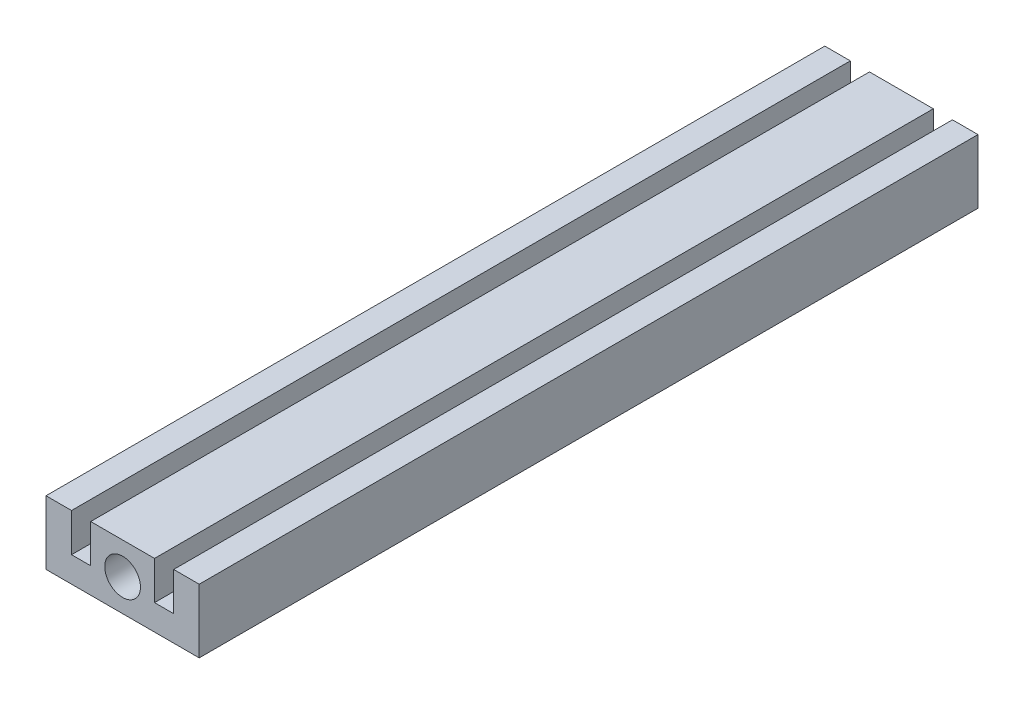
ISO-10303-21;
HEADER;
FILE_DESCRIPTION(('STEP AP214'),'2;1');
FILE_NAME('part.step','',(''),(''),'','','');
FILE_SCHEMA(('AUTOMOTIVE_DESIGN { 1 0 10303 214 1 1 1 1 }'));
ENDSEC;
DATA;
#1=APPLICATION_CONTEXT('core data for automotive mechanical design processes');
#2=APPLICATION_PROTOCOL_DEFINITION('international standard','automotive_design',2000,#1);
#3=PRODUCT_CONTEXT('',#1,'mechanical');
#4=PRODUCT('Part','Part','',(#3));
#5=PRODUCT_RELATED_PRODUCT_CATEGORY('part','',(#4));
#6=PRODUCT_DEFINITION_FORMATION('','',#4);
#7=PRODUCT_DEFINITION_CONTEXT('part definition',#1,'design');
#8=PRODUCT_DEFINITION('design','',#6,#7);
#9=PRODUCT_DEFINITION_SHAPE('','',#8);
#10=(LENGTH_UNIT() NAMED_UNIT(*) SI_UNIT(.MILLI.,.METRE.));
#11=(NAMED_UNIT(*) PLANE_ANGLE_UNIT() SI_UNIT($,.RADIAN.));
#12=(NAMED_UNIT(*) SI_UNIT($,.STERADIAN.) SOLID_ANGLE_UNIT());
#13=UNCERTAINTY_MEASURE_WITH_UNIT(LENGTH_MEASURE(1.E-05),#10,'distance_accuracy_value','');
#14=(GEOMETRIC_REPRESENTATION_CONTEXT(3) GLOBAL_UNCERTAINTY_ASSIGNED_CONTEXT((#13)) GLOBAL_UNIT_ASSIGNED_CONTEXT((#10,
#11,#12)) REPRESENTATION_CONTEXT('',''));
#15=CARTESIAN_POINT('',(0.,0.,0.));
#16=DIRECTION('',(0.,0.,1.));
#17=DIRECTION('',(1.,0.,0.));
#18=AXIS2_PLACEMENT_3D('',#15,#16,#17);
#19=CARTESIAN_POINT('',(0.,0.,122.));
#20=DIRECTION('',(0.,0.,1.));
#21=DIRECTION('',(1.,0.,0.));
#22=AXIS2_PLACEMENT_3D('',#19,#20,#21);
#23=PLANE('',#22);
#24=DIRECTION('',(-1.,0.,0.));
#25=VECTOR('',#24,1.);
#26=CARTESIAN_POINT('',(-8.00000000000003,5.,122.));
#27=LINE('',#26,#25);
#28=CARTESIAN_POINT('',(-8.00000000000003,5.,122.));
#29=VERTEX_POINT('',#28);
#30=CARTESIAN_POINT('',(-12.,5.,122.));
#31=VERTEX_POINT('',#30);
#32=EDGE_CURVE('E183',#29,#31,#27,.T.);
#33=ORIENTED_EDGE('',*,*,#32,.T.);
#34=DIRECTION('',(0.,-1.,0.));
#35=VECTOR('',#34,1.);
#36=CARTESIAN_POINT('',(-12.,5.,122.));
#37=LINE('',#36,#35);
#38=CARTESIAN_POINT('',(-12.,-5.,122.));
#39=VERTEX_POINT('',#38);
#40=EDGE_CURVE('E111',#31,#39,#37,.T.);
#41=ORIENTED_EDGE('',*,*,#40,.T.);
#42=DIRECTION('',(1.,0.,0.));
#43=VECTOR('',#42,1.);
#44=CARTESIAN_POINT('',(-12.,-5.,122.));
#45=LINE('',#44,#43);
#46=CARTESIAN_POINT('',(12.,-5.,122.));
#47=VERTEX_POINT('',#46);
#48=EDGE_CURVE('E210',#39,#47,#45,.T.);
#49=ORIENTED_EDGE('',*,*,#48,.T.);
#50=DIRECTION('',(0.,1.,0.));
#51=VECTOR('',#50,1.);
#52=CARTESIAN_POINT('',(12.,5.,122.));
#53=LINE('',#52,#51);
#54=CARTESIAN_POINT('',(12.,5.,122.));
#55=VERTEX_POINT('',#54);
#56=EDGE_CURVE('E229',#47,#55,#53,.T.);
#57=ORIENTED_EDGE('',*,*,#56,.T.);
#58=DIRECTION('',(-1.,0.,0.));
#59=VECTOR('',#58,1.);
#60=CARTESIAN_POINT('',(8.00000000000003,5.,122.));
#61=LINE('',#60,#59);
#62=CARTESIAN_POINT('',(8.00000000000003,5.,122.));
#63=VERTEX_POINT('',#62);
#64=EDGE_CURVE('E226',#55,#63,#61,.T.);
#65=ORIENTED_EDGE('',*,*,#64,.T.);
#66=DIRECTION('',(0.,-1.,0.));
#67=VECTOR('',#66,1.);
#68=CARTESIAN_POINT('',(8.,-0.999999999999963,122.));
#69=LINE('',#68,#67);
#70=CARTESIAN_POINT('',(8.,-0.999999999999963,122.));
#71=VERTEX_POINT('',#70);
#72=EDGE_CURVE('E228',#63,#71,#69,.T.);
#73=ORIENTED_EDGE('',*,*,#72,.T.);
#74=DIRECTION('',(-1.,0.,0.));
#75=VECTOR('',#74,1.);
#76=CARTESIAN_POINT('',(5.,-0.999999999999952,122.));
#77=LINE('',#76,#75);
#78=CARTESIAN_POINT('',(5.,-0.999999999999952,122.));
#79=VERTEX_POINT('',#78);
#80=EDGE_CURVE('E231',#71,#79,#77,.T.);
#81=ORIENTED_EDGE('',*,*,#80,.T.);
#82=DIRECTION('',(0.,1.,0.));
#83=VECTOR('',#82,1.);
#84=CARTESIAN_POINT('',(5.,5.,122.));
#85=LINE('',#84,#83);
#86=CARTESIAN_POINT('',(5.,5.,122.));
#87=VERTEX_POINT('',#86);
#88=EDGE_CURVE('E237',#79,#87,#85,.T.);
#89=ORIENTED_EDGE('',*,*,#88,.T.);
#90=DIRECTION('',(-1.,0.,0.));
#91=VECTOR('',#90,1.);
#92=CARTESIAN_POINT('',(5.,5.,122.));
#93=LINE('',#92,#91);
#94=CARTESIAN_POINT('',(-5.,5.,122.));
#95=VERTEX_POINT('',#94);
#96=EDGE_CURVE('E142',#87,#95,#93,.T.);
#97=ORIENTED_EDGE('',*,*,#96,.T.);
#98=DIRECTION('',(0.,-1.,0.));
#99=VECTOR('',#98,1.);
#100=CARTESIAN_POINT('',(-5.,5.,122.));
#101=LINE('',#100,#99);
#102=CARTESIAN_POINT('',(-5.,-0.999999999999952,122.));
#103=VERTEX_POINT('',#102);
#104=EDGE_CURVE('E136',#95,#103,#101,.T.);
#105=ORIENTED_EDGE('',*,*,#104,.T.);
#106=DIRECTION('',(-1.,0.,0.));
#107=VECTOR('',#106,1.);
#108=CARTESIAN_POINT('',(-5.,-0.999999999999952,122.));
#109=LINE('',#108,#107);
#110=CARTESIAN_POINT('',(-8.,-0.999999999999958,122.));
#111=VERTEX_POINT('',#110);
#112=EDGE_CURVE('E140',#103,#111,#109,.T.);
#113=ORIENTED_EDGE('',*,*,#112,.T.);
#114=DIRECTION('',(0.,1.,0.));
#115=VECTOR('',#114,1.);
#116=CARTESIAN_POINT('',(-8.,-0.999999999999958,122.));
#117=LINE('',#116,#115);
#118=EDGE_CURVE('E56',#111,#29,#117,.T.);
#119=ORIENTED_EDGE('',*,*,#118,.T.);
#120=EDGE_LOOP('',(#33,#41,#49,#57,#65,#73,#81,#89,#97,#105,#113,#119));
#121=FACE_BOUND('',#120,.T.);
#122=CARTESIAN_POINT('',(0.,0.,122.));
#123=DIRECTION('',(0.,0.,1.));
#124=DIRECTION('',(1.,0.,0.));
#125=AXIS2_PLACEMENT_3D('',#122,#123,#124);
#126=CIRCLE('',#125,2.8);
#127=CARTESIAN_POINT('',(2.8,0.,122.));
#128=VERTEX_POINT('',#127);
#129=EDGE_CURVE('E164',#128,#128,#126,.T.);
#130=ORIENTED_EDGE('',*,*,#129,.F.);
#131=EDGE_LOOP('',(#130));
#132=FACE_BOUND('',#131,.T.);
#133=ADVANCED_FACE('F39',(#121,#132),#23,.T.);
#134=CARTESIAN_POINT('',(0.,0.,0.));
#135=DIRECTION('',(0.,0.,1.));
#136=DIRECTION('',(1.,0.,0.));
#137=AXIS2_PLACEMENT_3D('',#134,#135,#136);
#138=PLANE('',#137);
#139=DIRECTION('',(-1.,0.,0.));
#140=VECTOR('',#139,1.);
#141=CARTESIAN_POINT('',(-8.00000000000003,5.,0.));
#142=LINE('',#141,#140);
#143=CARTESIAN_POINT('',(-8.00000000000003,5.,0.));
#144=VERTEX_POINT('',#143);
#145=CARTESIAN_POINT('',(-12.,5.,0.));
#146=VERTEX_POINT('',#145);
#147=EDGE_CURVE('E160',#144,#146,#142,.T.);
#148=ORIENTED_EDGE('',*,*,#147,.F.);
#149=DIRECTION('',(0.,1.,0.));
#150=VECTOR('',#149,1.);
#151=CARTESIAN_POINT('',(-8.,-0.999999999999958,0.));
#152=LINE('',#151,#150);
#153=CARTESIAN_POINT('',(-8.,-0.999999999999958,0.));
#154=VERTEX_POINT('',#153);
#155=EDGE_CURVE('E103',#154,#144,#152,.T.);
#156=ORIENTED_EDGE('',*,*,#155,.F.);
#157=DIRECTION('',(-1.,0.,0.));
#158=VECTOR('',#157,1.);
#159=CARTESIAN_POINT('',(-5.,-0.999999999999952,0.));
#160=LINE('',#159,#158);
#161=CARTESIAN_POINT('',(-5.,-0.999999999999952,0.));
#162=VERTEX_POINT('',#161);
#163=EDGE_CURVE('E97',#162,#154,#160,.T.);
#164=ORIENTED_EDGE('',*,*,#163,.F.);
#165=DIRECTION('',(0.,-1.,0.));
#166=VECTOR('',#165,1.);
#167=CARTESIAN_POINT('',(-5.,5.,0.));
#168=LINE('',#167,#166);
#169=CARTESIAN_POINT('',(-5.,5.,0.));
#170=VERTEX_POINT('',#169);
#171=EDGE_CURVE('E150',#170,#162,#168,.T.);
#172=ORIENTED_EDGE('',*,*,#171,.F.);
#173=DIRECTION('',(-1.,0.,0.));
#174=VECTOR('',#173,1.);
#175=CARTESIAN_POINT('',(5.,5.,0.));
#176=LINE('',#175,#174);
#177=CARTESIAN_POINT('',(5.,5.,0.));
#178=VERTEX_POINT('',#177);
#179=EDGE_CURVE('E178',#178,#170,#176,.T.);
#180=ORIENTED_EDGE('',*,*,#179,.F.);
#181=DIRECTION('',(0.,1.,0.));
#182=VECTOR('',#181,1.);
#183=CARTESIAN_POINT('',(5.,5.,0.));
#184=LINE('',#183,#182);
#185=CARTESIAN_POINT('',(5.,-0.999999999999952,0.));
#186=VERTEX_POINT('',#185);
#187=EDGE_CURVE('E176',#186,#178,#184,.T.);
#188=ORIENTED_EDGE('',*,*,#187,.F.);
#189=DIRECTION('',(-1.,0.,0.));
#190=VECTOR('',#189,1.);
#191=CARTESIAN_POINT('',(5.,-0.999999999999952,0.));
#192=LINE('',#191,#190);
#193=CARTESIAN_POINT('',(8.,-0.999999999999963,0.));
#194=VERTEX_POINT('',#193);
#195=EDGE_CURVE('E174',#194,#186,#192,.T.);
#196=ORIENTED_EDGE('',*,*,#195,.F.);
#197=DIRECTION('',(0.,-1.,0.));
#198=VECTOR('',#197,1.);
#199=CARTESIAN_POINT('',(8.,-0.999999999999963,0.));
#200=LINE('',#199,#198);
#201=CARTESIAN_POINT('',(8.00000000000003,5.,0.));
#202=VERTEX_POINT('',#201);
#203=EDGE_CURVE('E172',#202,#194,#200,.T.);
#204=ORIENTED_EDGE('',*,*,#203,.F.);
#205=DIRECTION('',(-1.,0.,0.));
#206=VECTOR('',#205,1.);
#207=CARTESIAN_POINT('',(8.00000000000003,5.,0.));
#208=LINE('',#207,#206);
#209=CARTESIAN_POINT('',(12.,5.,0.));
#210=VERTEX_POINT('',#209);
#211=EDGE_CURVE('E170',#210,#202,#208,.T.);
#212=ORIENTED_EDGE('',*,*,#211,.F.);
#213=DIRECTION('',(0.,1.,0.));
#214=VECTOR('',#213,1.);
#215=CARTESIAN_POINT('',(12.,5.,0.));
#216=LINE('',#215,#214);
#217=CARTESIAN_POINT('',(12.,-5.,0.));
#218=VERTEX_POINT('',#217);
#219=EDGE_CURVE('E168',#218,#210,#216,.T.);
#220=ORIENTED_EDGE('',*,*,#219,.F.);
#221=DIRECTION('',(1.,0.,0.));
#222=VECTOR('',#221,1.);
#223=CARTESIAN_POINT('',(-12.,-5.,0.));
#224=LINE('',#223,#222);
#225=CARTESIAN_POINT('',(-12.,-5.,0.));
#226=VERTEX_POINT('',#225);
#227=EDGE_CURVE('E166',#226,#218,#224,.T.);
#228=ORIENTED_EDGE('',*,*,#227,.F.);
#229=DIRECTION('',(0.,-1.,0.));
#230=VECTOR('',#229,1.);
#231=CARTESIAN_POINT('',(-12.,5.,0.));
#232=LINE('',#231,#230);
#233=EDGE_CURVE('E163',#146,#226,#232,.T.);
#234=ORIENTED_EDGE('',*,*,#233,.F.);
#235=EDGE_LOOP('',(#148,#156,#164,#172,#180,#188,#196,#204,#212,#220,#228,#234));
#236=FACE_BOUND('',#235,.T.);
#237=CARTESIAN_POINT('',(0.,0.,0.));
#238=DIRECTION('',(0.,0.,1.));
#239=DIRECTION('',(1.,0.,0.));
#240=AXIS2_PLACEMENT_3D('',#237,#238,#239);
#241=CIRCLE('',#240,2.8);
#242=CARTESIAN_POINT('',(2.8,0.,0.));
#243=VERTEX_POINT('',#242);
#244=EDGE_CURVE('E384',#243,#243,#241,.T.);
#245=ORIENTED_EDGE('',*,*,#244,.T.);
#246=EDGE_LOOP('',(#245));
#247=FACE_BOUND('',#246,.T.);
#248=ADVANCED_FACE('F214',(#236,#247),#138,.F.);
#249=CARTESIAN_POINT('',(-8.00000000000003,5.,122.));
#250=DIRECTION('',(0.,-1.,0.));
#251=DIRECTION('',(1.,0.,0.));
#252=AXIS2_PLACEMENT_3D('',#249,#250,#251);
#253=PLANE('',#252);
#254=ORIENTED_EDGE('',*,*,#147,.T.);
#255=DIRECTION('',(0.,0.,-1.));
#256=VECTOR('',#255,1.);
#257=CARTESIAN_POINT('',(-12.,5.,122.));
#258=LINE('',#257,#256);
#259=EDGE_CURVE('E11',#31,#146,#258,.T.);
#260=ORIENTED_EDGE('',*,*,#259,.F.);
#261=ORIENTED_EDGE('',*,*,#32,.F.);
#262=DIRECTION('',(0.,0.,-1.));
#263=VECTOR('',#262,1.);
#264=CARTESIAN_POINT('',(-8.00000000000003,5.,122.));
#265=LINE('',#264,#263);
#266=EDGE_CURVE('E156',#29,#144,#265,.T.);
#267=ORIENTED_EDGE('',*,*,#266,.T.);
#268=EDGE_LOOP('',(#254,#260,#261,#267));
#269=FACE_BOUND('',#268,.T.);
#270=ADVANCED_FACE('F41',(#269),#253,.F.);
#271=CARTESIAN_POINT('',(-12.,5.,122.));
#272=DIRECTION('',(1.,0.,0.));
#273=DIRECTION('',(0.,0.,-1.));
#274=AXIS2_PLACEMENT_3D('',#271,#272,#273);
#275=PLANE('',#274);
#276=ORIENTED_EDGE('',*,*,#233,.T.);
#277=DIRECTION('',(0.,0.,-1.));
#278=VECTOR('',#277,1.);
#279=CARTESIAN_POINT('',(-12.,-5.,122.));
#280=LINE('',#279,#278);
#281=EDGE_CURVE('E48',#39,#226,#280,.T.);
#282=ORIENTED_EDGE('',*,*,#281,.F.);
#283=ORIENTED_EDGE('',*,*,#40,.F.);
#284=ORIENTED_EDGE('',*,*,#259,.T.);
#285=EDGE_LOOP('',(#276,#282,#283,#284));
#286=FACE_BOUND('',#285,.T.);
#287=ADVANCED_FACE('F271',(#286),#275,.F.);
#288=CARTESIAN_POINT('',(-12.,-5.,122.));
#289=DIRECTION('',(0.,1.,0.));
#290=DIRECTION('',(0.,0.,1.));
#291=AXIS2_PLACEMENT_3D('',#288,#289,#290);
#292=PLANE('',#291);
#293=ORIENTED_EDGE('',*,*,#227,.T.);
#294=DIRECTION('',(0.,0.,-1.));
#295=VECTOR('',#294,1.);
#296=CARTESIAN_POINT('',(12.,-5.,122.));
#297=LINE('',#296,#295);
#298=EDGE_CURVE('E202',#47,#218,#297,.T.);
#299=ORIENTED_EDGE('',*,*,#298,.F.);
#300=ORIENTED_EDGE('',*,*,#48,.F.);
#301=ORIENTED_EDGE('',*,*,#281,.T.);
#302=EDGE_LOOP('',(#293,#299,#300,#301));
#303=FACE_BOUND('',#302,.T.);
#304=ADVANCED_FACE('F208',(#303),#292,.F.);
#305=CARTESIAN_POINT('',(12.,5.,122.));
#306=DIRECTION('',(-1.,0.,0.));
#307=DIRECTION('',(0.,0.,1.));
#308=AXIS2_PLACEMENT_3D('',#305,#306,#307);
#309=PLANE('',#308);
#310=ORIENTED_EDGE('',*,*,#219,.T.);
#311=DIRECTION('',(0.,0.,-1.));
#312=VECTOR('',#311,1.);
#313=CARTESIAN_POINT('',(12.,5.,122.));
#314=LINE('',#313,#312);
#315=EDGE_CURVE('E199',#55,#210,#314,.T.);
#316=ORIENTED_EDGE('',*,*,#315,.F.);
#317=ORIENTED_EDGE('',*,*,#56,.F.);
#318=ORIENTED_EDGE('',*,*,#298,.T.);
#319=EDGE_LOOP('',(#310,#316,#317,#318));
#320=FACE_BOUND('',#319,.T.);
#321=ADVANCED_FACE('F220',(#320),#309,.F.);
#322=CARTESIAN_POINT('',(8.00000000000003,5.,122.));
#323=DIRECTION('',(0.,-1.,0.));
#324=DIRECTION('',(1.,0.,0.));
#325=AXIS2_PLACEMENT_3D('',#322,#323,#324);
#326=PLANE('',#325);
#327=ORIENTED_EDGE('',*,*,#211,.T.);
#328=DIRECTION('',(0.,0.,-1.));
#329=VECTOR('',#328,1.);
#330=CARTESIAN_POINT('',(8.00000000000003,5.,122.));
#331=LINE('',#330,#329);
#332=EDGE_CURVE('E196',#63,#202,#331,.T.);
#333=ORIENTED_EDGE('',*,*,#332,.F.);
#334=ORIENTED_EDGE('',*,*,#64,.F.);
#335=ORIENTED_EDGE('',*,*,#315,.T.);
#336=EDGE_LOOP('',(#327,#333,#334,#335));
#337=FACE_BOUND('',#336,.T.);
#338=ADVANCED_FACE('F224',(#337),#326,.F.);
#339=CARTESIAN_POINT('',(8.,-0.999999999999963,122.));
#340=DIRECTION('',(1.,0.,0.));
#341=DIRECTION('',(0.,1.,0.));
#342=AXIS2_PLACEMENT_3D('',#339,#340,#341);
#343=PLANE('',#342);
#344=ORIENTED_EDGE('',*,*,#203,.T.);
#345=DIRECTION('',(0.,0.,-1.));
#346=VECTOR('',#345,1.);
#347=CARTESIAN_POINT('',(8.,-0.999999999999963,122.));
#348=LINE('',#347,#346);
#349=EDGE_CURVE('E193',#71,#194,#348,.T.);
#350=ORIENTED_EDGE('',*,*,#349,.F.);
#351=ORIENTED_EDGE('',*,*,#72,.F.);
#352=ORIENTED_EDGE('',*,*,#332,.T.);
#353=EDGE_LOOP('',(#344,#350,#351,#352));
#354=FACE_BOUND('',#353,.T.);
#355=ADVANCED_FACE('F284',(#354),#343,.F.);
#356=CARTESIAN_POINT('',(5.,-0.999999999999952,122.));
#357=DIRECTION('',(0.,-1.,0.));
#358=DIRECTION('',(1.,0.,0.));
#359=AXIS2_PLACEMENT_3D('',#356,#357,#358);
#360=PLANE('',#359);
#361=ORIENTED_EDGE('',*,*,#195,.T.);
#362=DIRECTION('',(0.,0.,-1.));
#363=VECTOR('',#362,1.);
#364=CARTESIAN_POINT('',(5.,-0.999999999999952,122.));
#365=LINE('',#364,#363);
#366=EDGE_CURVE('E190',#79,#186,#365,.T.);
#367=ORIENTED_EDGE('',*,*,#366,.F.);
#368=ORIENTED_EDGE('',*,*,#80,.F.);
#369=ORIENTED_EDGE('',*,*,#349,.T.);
#370=EDGE_LOOP('',(#361,#367,#368,#369));
#371=FACE_BOUND('',#370,.T.);
#372=ADVANCED_FACE('F287',(#371),#360,.F.);
#373=CARTESIAN_POINT('',(5.,5.,122.));
#374=DIRECTION('',(-1.,0.,0.));
#375=DIRECTION('',(0.,-1.,0.));
#376=AXIS2_PLACEMENT_3D('',#373,#374,#375);
#377=PLANE('',#376);
#378=ORIENTED_EDGE('',*,*,#187,.T.);
#379=DIRECTION('',(0.,0.,-1.));
#380=VECTOR('',#379,1.);
#381=CARTESIAN_POINT('',(5.,5.,122.));
#382=LINE('',#381,#380);
#383=EDGE_CURVE('E187',#87,#178,#382,.T.);
#384=ORIENTED_EDGE('',*,*,#383,.F.);
#385=ORIENTED_EDGE('',*,*,#88,.F.);
#386=ORIENTED_EDGE('',*,*,#366,.T.);
#387=EDGE_LOOP('',(#378,#384,#385,#386));
#388=FACE_BOUND('',#387,.T.);
#389=ADVANCED_FACE('F243',(#388),#377,.F.);
#390=CARTESIAN_POINT('',(5.,5.,122.));
#391=DIRECTION('',(0.,-1.,0.));
#392=DIRECTION('',(1.,0.,0.));
#393=AXIS2_PLACEMENT_3D('',#390,#391,#392);
#394=PLANE('',#393);
#395=ORIENTED_EDGE('',*,*,#179,.T.);
#396=DIRECTION('',(0.,0.,-1.));
#397=VECTOR('',#396,1.);
#398=CARTESIAN_POINT('',(-5.,5.,122.));
#399=LINE('',#398,#397);
#400=EDGE_CURVE('E151',#95,#170,#399,.T.);
#401=ORIENTED_EDGE('',*,*,#400,.F.);
#402=ORIENTED_EDGE('',*,*,#96,.F.);
#403=ORIENTED_EDGE('',*,*,#383,.T.);
#404=EDGE_LOOP('',(#395,#401,#402,#403));
#405=FACE_BOUND('',#404,.T.);
#406=ADVANCED_FACE('F247',(#405),#394,.F.);
#407=CARTESIAN_POINT('',(-5.,5.,122.));
#408=DIRECTION('',(1.,0.,0.));
#409=DIRECTION('',(0.,0.,-1.));
#410=AXIS2_PLACEMENT_3D('',#407,#408,#409);
#411=PLANE('',#410);
#412=ORIENTED_EDGE('',*,*,#171,.T.);
#413=DIRECTION('',(0.,0.,-1.));
#414=VECTOR('',#413,1.);
#415=CARTESIAN_POINT('',(-5.,-0.999999999999952,122.));
#416=LINE('',#415,#414);
#417=EDGE_CURVE('E147',#103,#162,#416,.T.);
#418=ORIENTED_EDGE('',*,*,#417,.F.);
#419=ORIENTED_EDGE('',*,*,#104,.F.);
#420=ORIENTED_EDGE('',*,*,#400,.T.);
#421=EDGE_LOOP('',(#412,#418,#419,#420));
#422=FACE_BOUND('',#421,.T.);
#423=ADVANCED_FACE('F148',(#422),#411,.F.);
#424=CARTESIAN_POINT('',(-5.,-0.999999999999952,122.));
#425=DIRECTION('',(0.,-1.,0.));
#426=DIRECTION('',(1.,0.,0.));
#427=AXIS2_PLACEMENT_3D('',#424,#425,#426);
#428=PLANE('',#427);
#429=ORIENTED_EDGE('',*,*,#163,.T.);
#430=DIRECTION('',(0.,0.,-1.));
#431=VECTOR('',#430,1.);
#432=CARTESIAN_POINT('',(-8.,-0.999999999999958,122.));
#433=LINE('',#432,#431);
#434=EDGE_CURVE('E152',#111,#154,#433,.T.);
#435=ORIENTED_EDGE('',*,*,#434,.F.);
#436=ORIENTED_EDGE('',*,*,#112,.F.);
#437=ORIENTED_EDGE('',*,*,#417,.T.);
#438=EDGE_LOOP('',(#429,#435,#436,#437));
#439=FACE_BOUND('',#438,.T.);
#440=ADVANCED_FACE('F154',(#439),#428,.F.);
#441=CARTESIAN_POINT('',(-8.,-0.999999999999958,122.));
#442=DIRECTION('',(-1.,0.,0.));
#443=DIRECTION('',(0.,-1.,0.));
#444=AXIS2_PLACEMENT_3D('',#441,#442,#443);
#445=PLANE('',#444);
#446=ORIENTED_EDGE('',*,*,#155,.T.);
#447=ORIENTED_EDGE('',*,*,#266,.F.);
#448=ORIENTED_EDGE('',*,*,#118,.F.);
#449=ORIENTED_EDGE('',*,*,#434,.T.);
#450=EDGE_LOOP('',(#446,#447,#448,#449));
#451=FACE_BOUND('',#450,.T.);
#452=ADVANCED_FACE('F251',(#451),#445,.F.);
#453=CARTESIAN_POINT('',(0.,0.,122.));
#454=DIRECTION('',(0.,0.,-1.));
#455=DIRECTION('',(-1.,0.,0.));
#456=AXIS2_PLACEMENT_3D('',#453,#454,#455);
#457=CYLINDRICAL_SURFACE('',#456,2.8);
#458=ORIENTED_EDGE('',*,*,#129,.T.);
#459=EDGE_LOOP('',(#458));
#460=FACE_BOUND('',#459,.T.);
#461=ORIENTED_EDGE('',*,*,#244,.F.);
#462=EDGE_LOOP('',(#461));
#463=FACE_BOUND('',#462,.T.);
#464=ADVANCED_FACE('F253',(#460,#463),#457,.F.);
#465=CLOSED_SHELL('',(#133,#248,#270,#287,#304,#321,#338,#355,#372,#389,#406,#423,#440,#452,#464));
#466=MANIFOLD_SOLID_BREP('B2',#465);
#467=ADVANCED_BREP_SHAPE_REPRESENTATION('',(#18,#466),#14);
#468=SHAPE_DEFINITION_REPRESENTATION(#9,#467);
ENDSEC;
END-ISO-10303-21;
